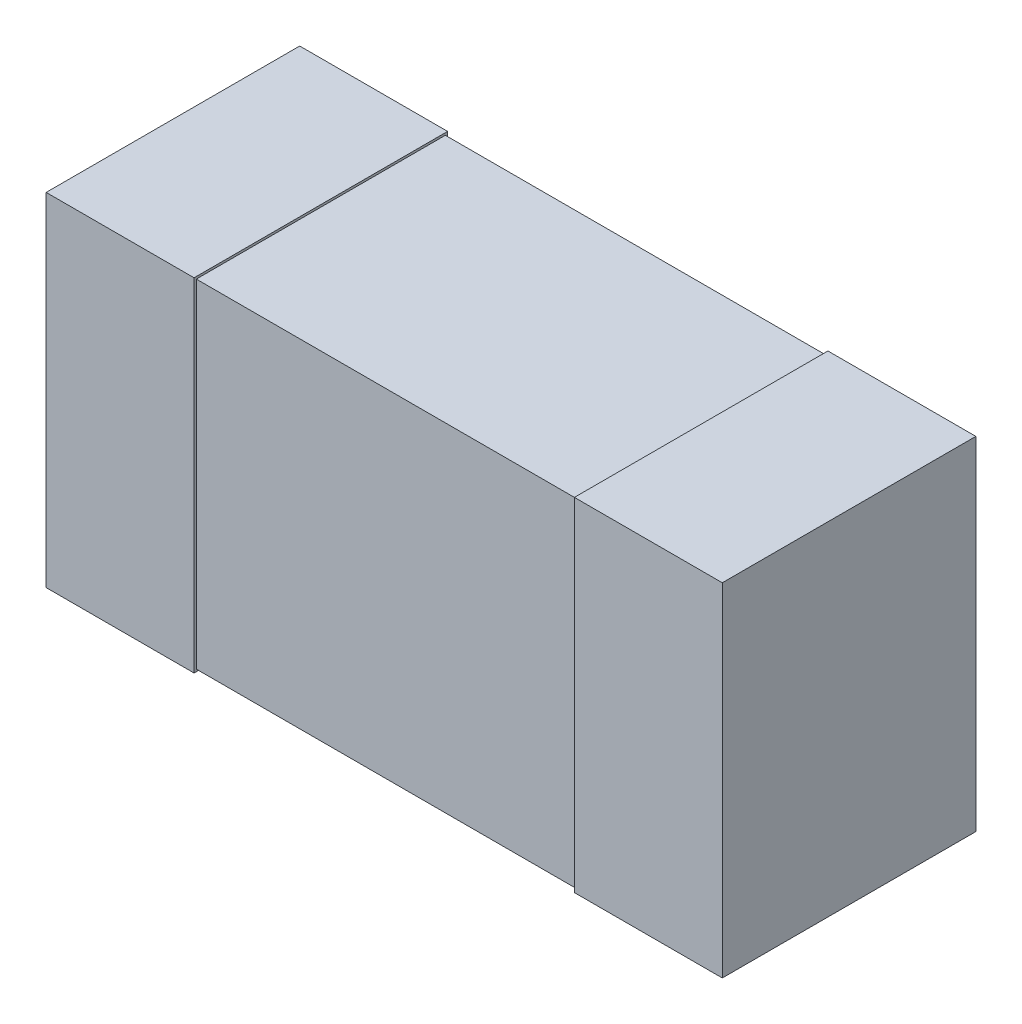
ISO-10303-21;
HEADER;
FILE_DESCRIPTION(('STEP AP214'),'2;1');
FILE_NAME('part.step','',(''),(''),'','','');
FILE_SCHEMA(('AUTOMOTIVE_DESIGN { 1 0 10303 214 1 1 1 1 }'));
ENDSEC;
DATA;
#1=APPLICATION_CONTEXT('core data for automotive mechanical design processes');
#2=APPLICATION_PROTOCOL_DEFINITION('international standard','automotive_design',2000,#1);
#3=PRODUCT_CONTEXT('',#1,'mechanical');
#4=PRODUCT('Part','Part','',(#3));
#5=PRODUCT_RELATED_PRODUCT_CATEGORY('part','',(#4));
#6=PRODUCT_DEFINITION_FORMATION('','',#4);
#7=PRODUCT_DEFINITION_CONTEXT('part definition',#1,'design');
#8=PRODUCT_DEFINITION('design','',#6,#7);
#9=PRODUCT_DEFINITION_SHAPE('','',#8);
#10=(LENGTH_UNIT() NAMED_UNIT(*) SI_UNIT(.MILLI.,.METRE.));
#11=(NAMED_UNIT(*) PLANE_ANGLE_UNIT() SI_UNIT($,.RADIAN.));
#12=(NAMED_UNIT(*) SI_UNIT($,.STERADIAN.) SOLID_ANGLE_UNIT());
#13=UNCERTAINTY_MEASURE_WITH_UNIT(LENGTH_MEASURE(1.E-05),#10,'distance_accuracy_value','');
#14=(GEOMETRIC_REPRESENTATION_CONTEXT(3) GLOBAL_UNCERTAINTY_ASSIGNED_CONTEXT((#13)) GLOBAL_UNIT_ASSIGNED_CONTEXT((#10,
#11,#12)) REPRESENTATION_CONTEXT('',''));
#15=CARTESIAN_POINT('',(0.,0.,0.));
#16=DIRECTION('',(0.,0.,1.));
#17=DIRECTION('',(1.,0.,0.));
#18=AXIS2_PLACEMENT_3D('',#15,#16,#17);
#19=CARTESIAN_POINT('',(0.8,-0.405,0.0762));
#20=DIRECTION('',(1.,0.,0.));
#21=DIRECTION('',(0.,1.,0.));
#22=AXIS2_PLACEMENT_3D('',#19,#20,#21);
#23=PLANE('',#22);
#24=DIRECTION('',(0.,1.,0.));
#25=VECTOR('',#24,1.);
#26=CARTESIAN_POINT('',(0.8,-0.405,0.0762));
#27=LINE('',#26,#25);
#28=CARTESIAN_POINT('',(0.8,-0.405,0.0762));
#29=VERTEX_POINT('',#28);
#30=CARTESIAN_POINT('',(0.8,0.405,0.0762));
#31=VERTEX_POINT('',#30);
#32=EDGE_CURVE('E178',#29,#31,#27,.T.);
#33=ORIENTED_EDGE('',*,*,#32,.T.);
#34=DIRECTION('',(0.,0.,1.));
#35=VECTOR('',#34,1.);
#36=CARTESIAN_POINT('',(0.8,0.405,0.0762));
#37=LINE('',#36,#35);
#38=CARTESIAN_POINT('',(0.8,0.405,0.6762));
#39=VERTEX_POINT('',#38);
#40=EDGE_CURVE('E167',#31,#39,#37,.T.);
#41=ORIENTED_EDGE('',*,*,#40,.T.);
#42=DIRECTION('',(0.,1.,0.));
#43=VECTOR('',#42,1.);
#44=CARTESIAN_POINT('',(0.8,-0.405,0.6762));
#45=LINE('',#44,#43);
#46=CARTESIAN_POINT('',(0.8,-0.405,0.6762));
#47=VERTEX_POINT('',#46);
#48=EDGE_CURVE('E216',#47,#39,#45,.T.);
#49=ORIENTED_EDGE('',*,*,#48,.F.);
#50=DIRECTION('',(0.,0.,1.));
#51=VECTOR('',#50,1.);
#52=CARTESIAN_POINT('',(0.8,-0.405,0.0762));
#53=LINE('',#52,#51);
#54=EDGE_CURVE('E11',#29,#47,#53,.T.);
#55=ORIENTED_EDGE('',*,*,#54,.F.);
#56=EDGE_LOOP('',(#33,#41,#49,#55));
#57=FACE_BOUND('',#56,.T.);
#58=ADVANCED_FACE('F16',(#57),#23,.T.);
#59=CARTESIAN_POINT('',(-0.8,0.405,0.0762));
#60=DIRECTION('',(-1.,0.,0.));
#61=DIRECTION('',(0.,0.,1.));
#62=AXIS2_PLACEMENT_3D('',#59,#60,#61);
#63=PLANE('',#62);
#64=DIRECTION('',(0.,-1.,0.));
#65=VECTOR('',#64,1.);
#66=CARTESIAN_POINT('',(-0.8,0.405,0.0762));
#67=LINE('',#66,#65);
#68=CARTESIAN_POINT('',(-0.8,0.405,0.0762));
#69=VERTEX_POINT('',#68);
#70=CARTESIAN_POINT('',(-0.8,-0.405,0.0762));
#71=VERTEX_POINT('',#70);
#72=EDGE_CURVE('E208',#69,#71,#67,.T.);
#73=ORIENTED_EDGE('',*,*,#72,.T.);
#74=DIRECTION('',(0.,0.,1.));
#75=VECTOR('',#74,1.);
#76=CARTESIAN_POINT('',(-0.8,-0.405,0.0762));
#77=LINE('',#76,#75);
#78=CARTESIAN_POINT('',(-0.8,-0.405,0.6762));
#79=VERTEX_POINT('',#78);
#80=EDGE_CURVE('E27',#71,#79,#77,.T.);
#81=ORIENTED_EDGE('',*,*,#80,.T.);
#82=DIRECTION('',(0.,-1.,0.));
#83=VECTOR('',#82,1.);
#84=CARTESIAN_POINT('',(-0.8,0.405,0.6762));
#85=LINE('',#84,#83);
#86=CARTESIAN_POINT('',(-0.8,0.405,0.6762));
#87=VERTEX_POINT('',#86);
#88=EDGE_CURVE('E175',#87,#79,#85,.T.);
#89=ORIENTED_EDGE('',*,*,#88,.F.);
#90=DIRECTION('',(0.,0.,1.));
#91=VECTOR('',#90,1.);
#92=CARTESIAN_POINT('',(-0.8,0.405,0.0762));
#93=LINE('',#92,#91);
#94=EDGE_CURVE('E122',#69,#87,#93,.T.);
#95=ORIENTED_EDGE('',*,*,#94,.F.);
#96=EDGE_LOOP('',(#73,#81,#89,#95));
#97=FACE_BOUND('',#96,.T.);
#98=ADVANCED_FACE('F329',(#97),#63,.T.);
#99=CARTESIAN_POINT('',(-0.8,-0.405,0.0762));
#100=DIRECTION('',(0.,-1.,0.));
#101=DIRECTION('',(0.,0.,-1.));
#102=AXIS2_PLACEMENT_3D('',#99,#100,#101);
#103=PLANE('',#102);
#104=DIRECTION('',(0.,0.,1.));
#105=VECTOR('',#104,1.);
#106=CARTESIAN_POINT('',(0.45,-0.405,0.0762));
#107=LINE('',#106,#105);
#108=CARTESIAN_POINT('',(0.45,-0.405,0.0762));
#109=VERTEX_POINT('',#108);
#110=CARTESIAN_POINT('',(0.45,-0.405,0.6762));
#111=VERTEX_POINT('',#110);
#112=EDGE_CURVE('E107',#109,#111,#107,.T.);
#113=ORIENTED_EDGE('',*,*,#112,.F.);
#114=DIRECTION('',(1.,0.,0.));
#115=VECTOR('',#114,1.);
#116=CARTESIAN_POINT('',(0.45,-0.405,0.0762));
#117=LINE('',#116,#115);
#118=EDGE_CURVE('E181',#109,#29,#117,.T.);
#119=ORIENTED_EDGE('',*,*,#118,.T.);
#120=ORIENTED_EDGE('',*,*,#54,.T.);
#121=DIRECTION('',(1.,0.,0.));
#122=VECTOR('',#121,1.);
#123=CARTESIAN_POINT('',(0.45,-0.405,0.6762));
#124=LINE('',#123,#122);
#125=EDGE_CURVE('E212',#111,#47,#124,.T.);
#126=ORIENTED_EDGE('',*,*,#125,.F.);
#127=EDGE_LOOP('',(#113,#119,#120,#126));
#128=FACE_BOUND('',#127,.T.);
#129=ADVANCED_FACE('F334',(#128),#103,.T.);
#130=CARTESIAN_POINT('',(-0.8,-0.405,0.0762));
#131=DIRECTION('',(0.,-1.,0.));
#132=DIRECTION('',(0.,0.,-1.));
#133=AXIS2_PLACEMENT_3D('',#130,#131,#132);
#134=PLANE('',#133);
#135=DIRECTION('',(0.,0.,1.));
#136=VECTOR('',#135,1.);
#137=CARTESIAN_POINT('',(-0.45,-0.405,0.0762));
#138=LINE('',#137,#136);
#139=CARTESIAN_POINT('',(-0.45,-0.405,0.0762));
#140=VERTEX_POINT('',#139);
#141=CARTESIAN_POINT('',(-0.45,-0.405,0.6762));
#142=VERTEX_POINT('',#141);
#143=EDGE_CURVE('E251',#140,#142,#138,.T.);
#144=ORIENTED_EDGE('',*,*,#143,.T.);
#145=DIRECTION('',(1.,0.,0.));
#146=VECTOR('',#145,1.);
#147=CARTESIAN_POINT('',(-0.8,-0.405,0.6762));
#148=LINE('',#147,#146);
#149=EDGE_CURVE('E94',#79,#142,#148,.T.);
#150=ORIENTED_EDGE('',*,*,#149,.F.);
#151=ORIENTED_EDGE('',*,*,#80,.F.);
#152=DIRECTION('',(1.,0.,0.));
#153=VECTOR('',#152,1.);
#154=CARTESIAN_POINT('',(-0.8,-0.405,0.0762));
#155=LINE('',#154,#153);
#156=EDGE_CURVE('E211',#71,#140,#155,.T.);
#157=ORIENTED_EDGE('',*,*,#156,.T.);
#158=EDGE_LOOP('',(#144,#150,#151,#157));
#159=FACE_BOUND('',#158,.T.);
#160=ADVANCED_FACE('F325',(#159),#134,.T.);
#161=CARTESIAN_POINT('',(0.,0.,0.6762));
#162=DIRECTION('',(0.,0.,1.));
#163=DIRECTION('',(1.,0.,0.));
#164=AXIS2_PLACEMENT_3D('',#161,#162,#163);
#165=PLANE('',#164);
#166=DIRECTION('',(0.,1.,0.));
#167=VECTOR('',#166,1.);
#168=CARTESIAN_POINT('',(0.45,-0.405,0.6762));
#169=LINE('',#168,#167);
#170=CARTESIAN_POINT('',(0.45,0.405,0.6762));
#171=VERTEX_POINT('',#170);
#172=EDGE_CURVE('E229',#111,#171,#169,.T.);
#173=ORIENTED_EDGE('',*,*,#172,.F.);
#174=ORIENTED_EDGE('',*,*,#125,.T.);
#175=ORIENTED_EDGE('',*,*,#48,.T.);
#176=DIRECTION('',(-1.,0.,0.));
#177=VECTOR('',#176,1.);
#178=CARTESIAN_POINT('',(0.8,0.405,0.6762));
#179=LINE('',#178,#177);
#180=EDGE_CURVE('E173',#39,#171,#179,.T.);
#181=ORIENTED_EDGE('',*,*,#180,.T.);
#182=EDGE_LOOP('',(#173,#174,#175,#181));
#183=FACE_BOUND('',#182,.T.);
#184=ADVANCED_FACE('F318',(#183),#165,.T.);
#185=CARTESIAN_POINT('',(0.,0.,0.6762));
#186=DIRECTION('',(0.,0.,1.));
#187=DIRECTION('',(1.,0.,0.));
#188=AXIS2_PLACEMENT_3D('',#185,#186,#187);
#189=PLANE('',#188);
#190=DIRECTION('',(0.,1.,0.));
#191=VECTOR('',#190,1.);
#192=CARTESIAN_POINT('',(-0.45,-0.405,0.6762));
#193=LINE('',#192,#191);
#194=CARTESIAN_POINT('',(-0.45,0.405,0.6762));
#195=VERTEX_POINT('',#194);
#196=EDGE_CURVE('E255',#142,#195,#193,.T.);
#197=ORIENTED_EDGE('',*,*,#196,.T.);
#198=DIRECTION('',(-1.,0.,0.));
#199=VECTOR('',#198,1.);
#200=CARTESIAN_POINT('',(-0.45,0.405,0.6762));
#201=LINE('',#200,#199);
#202=EDGE_CURVE('E197',#195,#87,#201,.T.);
#203=ORIENTED_EDGE('',*,*,#202,.T.);
#204=ORIENTED_EDGE('',*,*,#88,.T.);
#205=ORIENTED_EDGE('',*,*,#149,.T.);
#206=EDGE_LOOP('',(#197,#203,#204,#205));
#207=FACE_BOUND('',#206,.T.);
#208=ADVANCED_FACE('F18',(#207),#189,.T.);
#209=CARTESIAN_POINT('',(0.8,0.405,0.0762));
#210=DIRECTION('',(0.,1.,0.));
#211=DIRECTION('',(1.,0.,0.));
#212=AXIS2_PLACEMENT_3D('',#209,#210,#211);
#213=PLANE('',#212);
#214=DIRECTION('',(0.,0.,1.));
#215=VECTOR('',#214,1.);
#216=CARTESIAN_POINT('',(0.45,0.405,0.0762));
#217=LINE('',#216,#215);
#218=CARTESIAN_POINT('',(0.45,0.405,0.0762));
#219=VERTEX_POINT('',#218);
#220=EDGE_CURVE('E20',#219,#171,#217,.T.);
#221=ORIENTED_EDGE('',*,*,#220,.T.);
#222=ORIENTED_EDGE('',*,*,#180,.F.);
#223=ORIENTED_EDGE('',*,*,#40,.F.);
#224=DIRECTION('',(-1.,0.,0.));
#225=VECTOR('',#224,1.);
#226=CARTESIAN_POINT('',(0.8,0.405,0.0762));
#227=LINE('',#226,#225);
#228=EDGE_CURVE('E171',#31,#219,#227,.T.);
#229=ORIENTED_EDGE('',*,*,#228,.T.);
#230=EDGE_LOOP('',(#221,#222,#223,#229));
#231=FACE_BOUND('',#230,.T.);
#232=ADVANCED_FACE('F169',(#231),#213,.T.);
#233=CARTESIAN_POINT('',(0.8,0.405,0.0762));
#234=DIRECTION('',(0.,1.,0.));
#235=DIRECTION('',(1.,0.,0.));
#236=AXIS2_PLACEMENT_3D('',#233,#234,#235);
#237=PLANE('',#236);
#238=DIRECTION('',(0.,0.,1.));
#239=VECTOR('',#238,1.);
#240=CARTESIAN_POINT('',(-0.45,0.405,0.0762));
#241=LINE('',#240,#239);
#242=CARTESIAN_POINT('',(-0.45,0.405,0.0762));
#243=VERTEX_POINT('',#242);
#244=EDGE_CURVE('E224',#243,#195,#241,.T.);
#245=ORIENTED_EDGE('',*,*,#244,.F.);
#246=DIRECTION('',(-1.,0.,0.));
#247=VECTOR('',#246,1.);
#248=CARTESIAN_POINT('',(-0.45,0.405,0.0762));
#249=LINE('',#248,#247);
#250=EDGE_CURVE('E192',#243,#69,#249,.T.);
#251=ORIENTED_EDGE('',*,*,#250,.T.);
#252=ORIENTED_EDGE('',*,*,#94,.T.);
#253=ORIENTED_EDGE('',*,*,#202,.F.);
#254=EDGE_LOOP('',(#245,#251,#252,#253));
#255=FACE_BOUND('',#254,.T.);
#256=ADVANCED_FACE('F316',(#255),#237,.T.);
#257=CARTESIAN_POINT('',(0.45,-0.405,0.081534));
#258=DIRECTION('',(1.,0.,0.));
#259=DIRECTION('',(0.,1.,0.));
#260=AXIS2_PLACEMENT_3D('',#257,#258,#259);
#261=PLANE('',#260);
#262=DIRECTION('',(0.,1.,0.));
#263=VECTOR('',#262,1.);
#264=CARTESIAN_POINT('',(0.45,-0.399666,0.081534));
#265=LINE('',#264,#263);
#266=CARTESIAN_POINT('',(0.45,-0.399666,0.081534));
#267=VERTEX_POINT('',#266);
#268=CARTESIAN_POINT('',(0.45,0.399666,0.081534));
#269=VERTEX_POINT('',#268);
#270=EDGE_CURVE('E154',#267,#269,#265,.T.);
#271=ORIENTED_EDGE('',*,*,#270,.T.);
#272=DIRECTION('',(0.,0.,1.));
#273=VECTOR('',#272,1.);
#274=CARTESIAN_POINT('',(0.45,0.399666,0.081534));
#275=LINE('',#274,#273);
#276=CARTESIAN_POINT('',(0.45,0.399666,0.670866));
#277=VERTEX_POINT('',#276);
#278=EDGE_CURVE('E146',#269,#277,#275,.T.);
#279=ORIENTED_EDGE('',*,*,#278,.T.);
#280=DIRECTION('',(0.,-1.,0.));
#281=VECTOR('',#280,1.);
#282=CARTESIAN_POINT('',(0.45,0.399666,0.670866));
#283=LINE('',#282,#281);
#284=CARTESIAN_POINT('',(0.45,-0.399666,0.670866));
#285=VERTEX_POINT('',#284);
#286=EDGE_CURVE('E258',#277,#285,#283,.T.);
#287=ORIENTED_EDGE('',*,*,#286,.T.);
#288=DIRECTION('',(0.,0.,-1.));
#289=VECTOR('',#288,1.);
#290=CARTESIAN_POINT('',(0.45,-0.399666,0.670866));
#291=LINE('',#290,#289);
#292=EDGE_CURVE('E246',#285,#267,#291,.T.);
#293=ORIENTED_EDGE('',*,*,#292,.T.);
#294=EDGE_LOOP('',(#271,#279,#287,#293));
#295=FACE_BOUND('',#294,.T.);
#296=DIRECTION('',(0.,1.,0.));
#297=VECTOR('',#296,1.);
#298=CARTESIAN_POINT('',(0.45,-0.405,0.0762));
#299=LINE('',#298,#297);
#300=EDGE_CURVE('E185',#109,#219,#299,.T.);
#301=ORIENTED_EDGE('',*,*,#300,.F.);
#302=ORIENTED_EDGE('',*,*,#112,.T.);
#303=ORIENTED_EDGE('',*,*,#172,.T.);
#304=ORIENTED_EDGE('',*,*,#220,.F.);
#305=EDGE_LOOP('',(#301,#302,#303,#304));
#306=FACE_BOUND('',#305,.T.);
#307=ADVANCED_FACE('F295',(#295,#306),#261,.F.);
#308=CARTESIAN_POINT('',(-0.45,-0.405,0.081534));
#309=DIRECTION('',(0.,0.,1.));
#310=DIRECTION('',(1.,0.,0.));
#311=AXIS2_PLACEMENT_3D('',#308,#309,#310);
#312=PLANE('',#311);
#313=DIRECTION('',(1.,0.,0.));
#314=VECTOR('',#313,1.);
#315=CARTESIAN_POINT('',(-0.45,-0.399666,0.081534));
#316=LINE('',#315,#314);
#317=CARTESIAN_POINT('',(-0.45,-0.399666,0.081534));
#318=VERTEX_POINT('',#317);
#319=EDGE_CURVE('E202',#318,#267,#316,.T.);
#320=ORIENTED_EDGE('',*,*,#319,.F.);
#321=DIRECTION('',(0.,1.,0.));
#322=VECTOR('',#321,1.);
#323=CARTESIAN_POINT('',(-0.45,-0.399666,0.081534));
#324=LINE('',#323,#322);
#325=CARTESIAN_POINT('',(-0.45,0.399666,0.081534));
#326=VERTEX_POINT('',#325);
#327=EDGE_CURVE('E203',#318,#326,#324,.T.);
#328=ORIENTED_EDGE('',*,*,#327,.T.);
#329=DIRECTION('',(1.,0.,0.));
#330=VECTOR('',#329,1.);
#331=CARTESIAN_POINT('',(-0.45,0.399666,0.081534));
#332=LINE('',#331,#330);
#333=EDGE_CURVE('E261',#326,#269,#332,.T.);
#334=ORIENTED_EDGE('',*,*,#333,.T.);
#335=ORIENTED_EDGE('',*,*,#270,.F.);
#336=EDGE_LOOP('',(#320,#328,#334,#335));
#337=FACE_BOUND('',#336,.T.);
#338=ADVANCED_FACE('F298',(#337),#312,.F.);
#339=CARTESIAN_POINT('',(-0.45,0.399666,0.0762));
#340=DIRECTION('',(0.,-1.,0.));
#341=DIRECTION('',(0.,0.,-1.));
#342=AXIS2_PLACEMENT_3D('',#339,#340,#341);
#343=PLANE('',#342);
#344=ORIENTED_EDGE('',*,*,#333,.F.);
#345=DIRECTION('',(0.,0.,1.));
#346=VECTOR('',#345,1.);
#347=CARTESIAN_POINT('',(-0.45,0.399666,0.081534));
#348=LINE('',#347,#346);
#349=CARTESIAN_POINT('',(-0.45,0.399666,0.670866));
#350=VERTEX_POINT('',#349);
#351=EDGE_CURVE('E267',#326,#350,#348,.T.);
#352=ORIENTED_EDGE('',*,*,#351,.T.);
#353=DIRECTION('',(1.,0.,0.));
#354=VECTOR('',#353,1.);
#355=CARTESIAN_POINT('',(-0.45,0.399666,0.670866));
#356=LINE('',#355,#354);
#357=EDGE_CURVE('E254',#350,#277,#356,.T.);
#358=ORIENTED_EDGE('',*,*,#357,.T.);
#359=ORIENTED_EDGE('',*,*,#278,.F.);
#360=EDGE_LOOP('',(#344,#352,#358,#359));
#361=FACE_BOUND('',#360,.T.);
#362=ADVANCED_FACE('F289',(#361),#343,.F.);
#363=CARTESIAN_POINT('',(-0.45,0.405,0.670866));
#364=DIRECTION('',(0.,0.,-1.));
#365=DIRECTION('',(0.,-1.,0.));
#366=AXIS2_PLACEMENT_3D('',#363,#364,#365);
#367=PLANE('',#366);
#368=ORIENTED_EDGE('',*,*,#357,.F.);
#369=DIRECTION('',(0.,-1.,0.));
#370=VECTOR('',#369,1.);
#371=CARTESIAN_POINT('',(-0.45,0.399666,0.670866));
#372=LINE('',#371,#370);
#373=CARTESIAN_POINT('',(-0.45,-0.399666,0.670866));
#374=VERTEX_POINT('',#373);
#375=EDGE_CURVE('E250',#350,#374,#372,.T.);
#376=ORIENTED_EDGE('',*,*,#375,.T.);
#377=DIRECTION('',(1.,0.,0.));
#378=VECTOR('',#377,1.);
#379=CARTESIAN_POINT('',(-0.45,-0.399666,0.670866));
#380=LINE('',#379,#378);
#381=EDGE_CURVE('E79',#374,#285,#380,.T.);
#382=ORIENTED_EDGE('',*,*,#381,.T.);
#383=ORIENTED_EDGE('',*,*,#286,.F.);
#384=EDGE_LOOP('',(#368,#376,#382,#383));
#385=FACE_BOUND('',#384,.T.);
#386=ADVANCED_FACE('F293',(#385),#367,.F.);
#387=CARTESIAN_POINT('',(-0.45,-0.399666,0.6762));
#388=DIRECTION('',(0.,1.,0.));
#389=DIRECTION('',(1.,0.,0.));
#390=AXIS2_PLACEMENT_3D('',#387,#388,#389);
#391=PLANE('',#390);
#392=ORIENTED_EDGE('',*,*,#381,.F.);
#393=DIRECTION('',(0.,0.,-1.));
#394=VECTOR('',#393,1.);
#395=CARTESIAN_POINT('',(-0.45,-0.399666,0.670866));
#396=LINE('',#395,#394);
#397=EDGE_CURVE('E247',#374,#318,#396,.T.);
#398=ORIENTED_EDGE('',*,*,#397,.T.);
#399=ORIENTED_EDGE('',*,*,#319,.T.);
#400=ORIENTED_EDGE('',*,*,#292,.F.);
#401=EDGE_LOOP('',(#392,#398,#399,#400));
#402=FACE_BOUND('',#401,.T.);
#403=ADVANCED_FACE('F296',(#402),#391,.F.);
#404=CARTESIAN_POINT('',(-0.45,-0.405,0.0762));
#405=DIRECTION('',(-1.,0.,0.));
#406=DIRECTION('',(0.,0.,1.));
#407=AXIS2_PLACEMENT_3D('',#404,#405,#406);
#408=PLANE('',#407);
#409=ORIENTED_EDGE('',*,*,#397,.F.);
#410=ORIENTED_EDGE('',*,*,#375,.F.);
#411=ORIENTED_EDGE('',*,*,#351,.F.);
#412=ORIENTED_EDGE('',*,*,#327,.F.);
#413=EDGE_LOOP('',(#409,#410,#411,#412));
#414=FACE_BOUND('',#413,.T.);
#415=DIRECTION('',(0.,1.,0.));
#416=VECTOR('',#415,1.);
#417=CARTESIAN_POINT('',(-0.45,-0.405,0.0762));
#418=LINE('',#417,#416);
#419=EDGE_CURVE('E217',#140,#243,#418,.T.);
#420=ORIENTED_EDGE('',*,*,#419,.T.);
#421=ORIENTED_EDGE('',*,*,#244,.T.);
#422=ORIENTED_EDGE('',*,*,#196,.F.);
#423=ORIENTED_EDGE('',*,*,#143,.F.);
#424=EDGE_LOOP('',(#420,#421,#422,#423));
#425=FACE_BOUND('',#424,.T.);
#426=ADVANCED_FACE('F300',(#414,#425),#408,.F.);
#427=CARTESIAN_POINT('',(0.,0.,0.0762));
#428=DIRECTION('',(0.,0.,1.));
#429=DIRECTION('',(1.,0.,0.));
#430=AXIS2_PLACEMENT_3D('',#427,#428,#429);
#431=PLANE('',#430);
#432=ORIENTED_EDGE('',*,*,#300,.T.);
#433=ORIENTED_EDGE('',*,*,#228,.F.);
#434=ORIENTED_EDGE('',*,*,#32,.F.);
#435=ORIENTED_EDGE('',*,*,#118,.F.);
#436=EDGE_LOOP('',(#432,#433,#434,#435));
#437=FACE_BOUND('',#436,.T.);
#438=ADVANCED_FACE('F183',(#437),#431,.F.);
#439=CARTESIAN_POINT('',(0.,0.,0.0762));
#440=DIRECTION('',(0.,0.,1.));
#441=DIRECTION('',(1.,0.,0.));
#442=AXIS2_PLACEMENT_3D('',#439,#440,#441);
#443=PLANE('',#442);
#444=ORIENTED_EDGE('',*,*,#419,.F.);
#445=ORIENTED_EDGE('',*,*,#156,.F.);
#446=ORIENTED_EDGE('',*,*,#72,.F.);
#447=ORIENTED_EDGE('',*,*,#250,.F.);
#448=EDGE_LOOP('',(#444,#445,#446,#447));
#449=FACE_BOUND('',#448,.T.);
#450=ADVANCED_FACE('F311',(#449),#443,.F.);
#451=CLOSED_SHELL('',(#58,#98,#129,#160,#184,#208,#232,#256,#307,#338,#362,#386,#403,#426,#438,#450));
#452=MANIFOLD_SOLID_BREP('B1',#451);
#453=ADVANCED_BREP_SHAPE_REPRESENTATION('',(#18,#452),#14);
#454=SHAPE_DEFINITION_REPRESENTATION(#9,#453);
ENDSEC;
END-ISO-10303-21;
